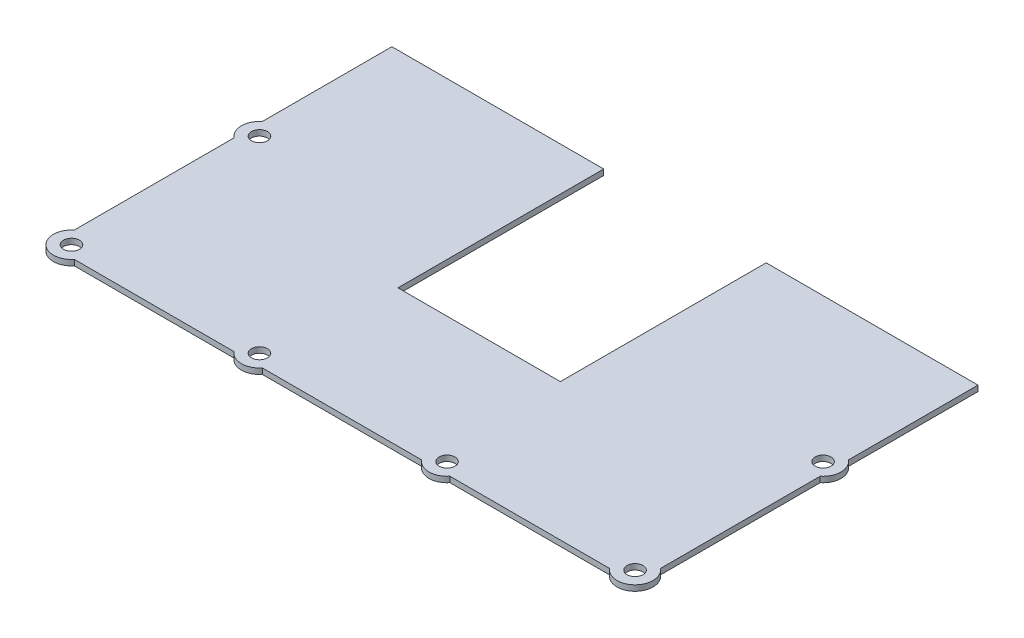
ISO-10303-21;
HEADER;
FILE_DESCRIPTION(('STEP AP214'),'2;1');
FILE_NAME('part.step','',(''),(''),'','','');
FILE_SCHEMA(('AUTOMOTIVE_DESIGN { 1 0 10303 214 1 1 1 1 }'));
ENDSEC;
DATA;
#1=APPLICATION_CONTEXT('core data for automotive mechanical design processes');
#2=APPLICATION_PROTOCOL_DEFINITION('international standard','automotive_design',2000,#1);
#3=PRODUCT_CONTEXT('',#1,'mechanical');
#4=PRODUCT('Part','Part','',(#3));
#5=PRODUCT_RELATED_PRODUCT_CATEGORY('part','',(#4));
#6=PRODUCT_DEFINITION_FORMATION('','',#4);
#7=PRODUCT_DEFINITION_CONTEXT('part definition',#1,'design');
#8=PRODUCT_DEFINITION('design','',#6,#7);
#9=PRODUCT_DEFINITION_SHAPE('','',#8);
#10=(LENGTH_UNIT() NAMED_UNIT(*) SI_UNIT(.MILLI.,.METRE.));
#11=(NAMED_UNIT(*) PLANE_ANGLE_UNIT() SI_UNIT($,.RADIAN.));
#12=(NAMED_UNIT(*) SI_UNIT($,.STERADIAN.) SOLID_ANGLE_UNIT());
#13=UNCERTAINTY_MEASURE_WITH_UNIT(LENGTH_MEASURE(1.E-05),#10,'distance_accuracy_value','');
#14=(GEOMETRIC_REPRESENTATION_CONTEXT(3) GLOBAL_UNCERTAINTY_ASSIGNED_CONTEXT((#13)) GLOBAL_UNIT_ASSIGNED_CONTEXT((#10,
#11,#12)) REPRESENTATION_CONTEXT('',''));
#15=CARTESIAN_POINT('',(0.,0.,0.));
#16=DIRECTION('',(0.,0.,1.));
#17=DIRECTION('',(1.,0.,0.));
#18=AXIS2_PLACEMENT_3D('',#15,#16,#17);
#19=CARTESIAN_POINT('',(161.799492169997,1.5875,40.4400835330655));
#20=DIRECTION('',(0.,1.,0.));
#21=DIRECTION('',(0.,0.,1.));
#22=AXIS2_PLACEMENT_3D('',#19,#20,#21);
#23=PLANE('',#22);
#24=CARTESIAN_POINT('',(161.799492169997,1.5875,93.3567501997322));
#25=DIRECTION('',(0.,1.,0.));
#26=DIRECTION('',(0.,0.,1.));
#27=AXIS2_PLACEMENT_3D('',#24,#25,#26);
#28=CIRCLE('',#27,2.2479);
#29=CARTESIAN_POINT('',(161.799492169997,1.5875,95.6046501997322));
#30=VERTEX_POINT('',#29);
#31=EDGE_CURVE('E437',#30,#30,#28,.T.);
#32=ORIENTED_EDGE('',*,*,#31,.F.);
#33=EDGE_LOOP('',(#32));
#34=FACE_BOUND('',#33,.T.);
#35=CARTESIAN_POINT('',(56.0916666666667,1.5875,93.3567501997322));
#36=DIRECTION('',(0.,1.,0.));
#37=DIRECTION('',(0.,0.,1.));
#38=AXIS2_PLACEMENT_3D('',#35,#36,#37);
#39=CIRCLE('',#38,2.2479);
#40=CARTESIAN_POINT('',(56.0916666666667,1.5875,95.6046501997322));
#41=VERTEX_POINT('',#40);
#42=EDGE_CURVE('E453',#41,#41,#39,.T.);
#43=ORIENTED_EDGE('',*,*,#42,.F.);
#44=EDGE_LOOP('',(#43));
#45=FACE_BOUND('',#44,.T.);
#46=CARTESIAN_POINT('',(3.17499999999999,1.5875,40.4400835330655));
#47=DIRECTION('',(0.,1.,0.));
#48=DIRECTION('',(0.,0.,1.));
#49=AXIS2_PLACEMENT_3D('',#46,#47,#48);
#50=CIRCLE('',#49,2.2479);
#51=CARTESIAN_POINT('',(3.17499999999999,1.5875,42.6879835330655));
#52=VERTEX_POINT('',#51);
#53=EDGE_CURVE('E206',#52,#52,#50,.T.);
#54=ORIENTED_EDGE('',*,*,#53,.F.);
#55=EDGE_LOOP('',(#54));
#56=FACE_BOUND('',#55,.T.);
#57=DIRECTION('',(0.,0.,-1.));
#58=VECTOR('',#57,1.);
#59=CARTESIAN_POINT('',(59.6265,1.5875,0.));
#60=LINE('',#59,#58);
#61=CARTESIAN_POINT('',(59.6265,1.5875,57.9237501997322));
#62=VERTEX_POINT('',#61);
#63=CARTESIAN_POINT('',(59.6265,1.5875,0.));
#64=VERTEX_POINT('',#63);
#65=EDGE_CURVE('E255',#62,#64,#60,.T.);
#66=ORIENTED_EDGE('',*,*,#65,.T.);
#67=DIRECTION('',(-1.,0.,0.));
#68=VECTOR('',#67,1.);
#69=CARTESIAN_POINT('',(59.6265,1.5875,0.));
#70=LINE('',#69,#68);
#71=CARTESIAN_POINT('',(0.,1.5875,0.));
#72=VERTEX_POINT('',#71);
#73=EDGE_CURVE('E130',#64,#72,#70,.T.);
#74=ORIENTED_EDGE('',*,*,#73,.T.);
#75=DIRECTION('',(0.,0.,1.));
#76=VECTOR('',#75,1.);
#77=CARTESIAN_POINT('',(0.,1.5875,0.));
#78=LINE('',#77,#76);
#79=CARTESIAN_POINT('',(0.,1.5875,36.4745098040825));
#80=VERTEX_POINT('',#79);
#81=EDGE_CURVE('E316',#72,#80,#78,.T.);
#82=ORIENTED_EDGE('',*,*,#81,.T.);
#83=CARTESIAN_POINT('',(3.175,1.5875,40.4400835330655));
#84=DIRECTION('',(0.,1.,0.));
#85=DIRECTION('',(0.,0.,1.));
#86=AXIS2_PLACEMENT_3D('',#83,#84,#85);
#87=CIRCLE('',#86,5.08);
#88=CARTESIAN_POINT('',(0.,1.5875,44.4056572620485));
#89=VERTEX_POINT('',#88);
#90=EDGE_CURVE('E336',#80,#89,#87,.T.);
#91=ORIENTED_EDGE('',*,*,#90,.T.);
#92=DIRECTION('',(0.,0.,1.));
#93=VECTOR('',#92,1.);
#94=CARTESIAN_POINT('',(0.,1.5875,44.4056572620485));
#95=LINE('',#94,#93);
#96=CARTESIAN_POINT('',(0.,1.5875,89.3911764707492));
#97=VERTEX_POINT('',#96);
#98=EDGE_CURVE('E332',#89,#97,#95,.T.);
#99=ORIENTED_EDGE('',*,*,#98,.T.);
#100=CARTESIAN_POINT('',(3.175,1.5875,93.3567501997322));
#101=DIRECTION('',(0.,1.,0.));
#102=DIRECTION('',(0.,0.,1.));
#103=AXIS2_PLACEMENT_3D('',#100,#101,#102);
#104=CIRCLE('',#103,5.07999999999999);
#105=CARTESIAN_POINT('',(7.14057372898299,1.5875,96.5317501997322));
#106=VERTEX_POINT('',#105);
#107=EDGE_CURVE('E335',#97,#106,#104,.T.);
#108=ORIENTED_EDGE('',*,*,#107,.T.);
#109=DIRECTION('',(1.,0.,0.));
#110=VECTOR('',#109,1.);
#111=CARTESIAN_POINT('',(7.14057372898299,1.5875,96.5317501997322));
#112=LINE('',#111,#110);
#113=CARTESIAN_POINT('',(52.1260929376837,1.5875,96.5317501997322));
#114=VERTEX_POINT('',#113);
#115=EDGE_CURVE('E340',#106,#114,#112,.T.);
#116=ORIENTED_EDGE('',*,*,#115,.T.);
#117=CARTESIAN_POINT('',(56.0916666666667,1.5875,93.3567501997322));
#118=DIRECTION('',(0.,1.,0.));
#119=DIRECTION('',(0.,0.,1.));
#120=AXIS2_PLACEMENT_3D('',#117,#118,#119);
#121=CIRCLE('',#120,5.08000000000002);
#122=CARTESIAN_POINT('',(60.0572403956497,1.5875,96.5317501997322));
#123=VERTEX_POINT('',#122);
#124=EDGE_CURVE('E347',#114,#123,#121,.T.);
#125=ORIENTED_EDGE('',*,*,#124,.T.);
#126=DIRECTION('',(1.,0.,0.));
#127=VECTOR('',#126,1.);
#128=CARTESIAN_POINT('',(60.0572403956497,1.5875,96.5317501997322));
#129=LINE('',#128,#127);
#130=CARTESIAN_POINT('',(104.917251774347,1.5875,96.5317501997322));
#131=VERTEX_POINT('',#130);
#132=EDGE_CURVE('E350',#123,#131,#129,.T.);
#133=ORIENTED_EDGE('',*,*,#132,.T.);
#134=CARTESIAN_POINT('',(108.88282550333,1.5875,93.3567501997322));
#135=DIRECTION('',(0.,1.,0.));
#136=DIRECTION('',(0.,0.,1.));
#137=AXIS2_PLACEMENT_3D('',#134,#135,#136);
#138=CIRCLE('',#137,5.07999999999999);
#139=CARTESIAN_POINT('',(112.848399232313,1.5875,96.5317501997322));
#140=VERTEX_POINT('',#139);
#141=EDGE_CURVE('E353',#131,#140,#138,.T.);
#142=ORIENTED_EDGE('',*,*,#141,.T.);
#143=DIRECTION('',(1.,0.,0.));
#144=VECTOR('',#143,1.);
#145=CARTESIAN_POINT('',(112.848399232313,1.5875,96.5317501997322));
#146=LINE('',#145,#144);
#147=CARTESIAN_POINT('',(157.833918441014,1.5875,96.5317501997322));
#148=VERTEX_POINT('',#147);
#149=EDGE_CURVE('E356',#140,#148,#146,.T.);
#150=ORIENTED_EDGE('',*,*,#149,.T.);
#151=CARTESIAN_POINT('',(161.799492169997,1.5875,93.3567501997322));
#152=DIRECTION('',(0.,1.,0.));
#153=DIRECTION('',(0.,0.,1.));
#154=AXIS2_PLACEMENT_3D('',#151,#152,#153);
#155=CIRCLE('',#154,5.08000000000002);
#156=CARTESIAN_POINT('',(164.974492169997,1.5875,89.3911764707492));
#157=VERTEX_POINT('',#156);
#158=EDGE_CURVE('E359',#148,#157,#155,.T.);
#159=ORIENTED_EDGE('',*,*,#158,.T.);
#160=DIRECTION('',(0.,0.,-1.));
#161=VECTOR('',#160,1.);
#162=CARTESIAN_POINT('',(164.974492169997,1.5875,89.3911764707492));
#163=LINE('',#162,#161);
#164=CARTESIAN_POINT('',(164.974492169997,1.5875,44.4056572620485));
#165=VERTEX_POINT('',#164);
#166=EDGE_CURVE('E362',#157,#165,#163,.T.);
#167=ORIENTED_EDGE('',*,*,#166,.T.);
#168=CARTESIAN_POINT('',(161.799492169997,1.5875,40.4400835330655));
#169=DIRECTION('',(0.,1.,0.));
#170=DIRECTION('',(0.,0.,1.));
#171=AXIS2_PLACEMENT_3D('',#168,#169,#170);
#172=CIRCLE('',#171,5.08000000000001);
#173=CARTESIAN_POINT('',(164.974492169997,1.5875,36.4745098040825));
#174=VERTEX_POINT('',#173);
#175=EDGE_CURVE('E365',#165,#174,#172,.T.);
#176=ORIENTED_EDGE('',*,*,#175,.T.);
#177=DIRECTION('',(0.,0.,-1.));
#178=VECTOR('',#177,1.);
#179=CARTESIAN_POINT('',(164.974492169997,1.5875,36.4745098040825));
#180=LINE('',#179,#178);
#181=CARTESIAN_POINT('',(164.974492169997,1.5875,0.));
#182=VERTEX_POINT('',#181);
#183=EDGE_CURVE('E179',#174,#182,#180,.T.);
#184=ORIENTED_EDGE('',*,*,#183,.T.);
#185=DIRECTION('',(-1.,0.,0.));
#186=VECTOR('',#185,1.);
#187=CARTESIAN_POINT('',(164.974492169997,1.5875,0.));
#188=LINE('',#187,#186);
#189=CARTESIAN_POINT('',(105.347992169997,1.5875,0.));
#190=VERTEX_POINT('',#189);
#191=EDGE_CURVE('E173',#182,#190,#188,.T.);
#192=ORIENTED_EDGE('',*,*,#191,.T.);
#193=DIRECTION('',(0.,0.,1.));
#194=VECTOR('',#193,1.);
#195=CARTESIAN_POINT('',(105.347992169997,1.5875,0.));
#196=LINE('',#195,#194);
#197=CARTESIAN_POINT('',(105.347992169997,1.5875,57.9237501997322));
#198=VERTEX_POINT('',#197);
#199=EDGE_CURVE('E177',#190,#198,#196,.T.);
#200=ORIENTED_EDGE('',*,*,#199,.T.);
#201=DIRECTION('',(-1.,0.,0.));
#202=VECTOR('',#201,1.);
#203=CARTESIAN_POINT('',(59.6265,1.5875,57.9237501997322));
#204=LINE('',#203,#202);
#205=EDGE_CURVE('E57',#198,#62,#204,.T.);
#206=ORIENTED_EDGE('',*,*,#205,.T.);
#207=EDGE_LOOP('',(#66,#74,#82,#91,#99,#108,#116,#125,#133,#142,#150,#159,#167,#176,#184,#192,
#200,#206));
#208=FACE_BOUND('',#207,.T.);
#209=CARTESIAN_POINT('',(3.17499999999999,1.5875,93.3567501997322));
#210=DIRECTION('',(0.,1.,0.));
#211=DIRECTION('',(0.,0.,1.));
#212=AXIS2_PLACEMENT_3D('',#209,#210,#211);
#213=CIRCLE('',#212,2.2479);
#214=CARTESIAN_POINT('',(3.17499999999999,1.5875,95.6046501997322));
#215=VERTEX_POINT('',#214);
#216=EDGE_CURVE('E461',#215,#215,#213,.T.);
#217=ORIENTED_EDGE('',*,*,#216,.F.);
#218=EDGE_LOOP('',(#217));
#219=FACE_BOUND('',#218,.T.);
#220=CARTESIAN_POINT('',(108.88282550333,1.5875,93.3567501997322));
#221=DIRECTION('',(0.,1.,0.));
#222=DIRECTION('',(0.,0.,1.));
#223=AXIS2_PLACEMENT_3D('',#220,#221,#222);
#224=CIRCLE('',#223,2.2479);
#225=CARTESIAN_POINT('',(108.88282550333,1.5875,95.6046501997322));
#226=VERTEX_POINT('',#225);
#227=EDGE_CURVE('E445',#226,#226,#224,.T.);
#228=ORIENTED_EDGE('',*,*,#227,.F.);
#229=EDGE_LOOP('',(#228));
#230=FACE_BOUND('',#229,.T.);
#231=CARTESIAN_POINT('',(161.799492169997,1.5875,40.4400835330655));
#232=DIRECTION('',(0.,1.,0.));
#233=DIRECTION('',(0.,0.,1.));
#234=AXIS2_PLACEMENT_3D('',#231,#232,#233);
#235=CIRCLE('',#234,2.2479);
#236=CARTESIAN_POINT('',(161.799492169997,1.5875,42.6879835330655));
#237=VERTEX_POINT('',#236);
#238=EDGE_CURVE('E426',#237,#237,#235,.T.);
#239=ORIENTED_EDGE('',*,*,#238,.F.);
#240=EDGE_LOOP('',(#239));
#241=FACE_BOUND('',#240,.T.);
#242=ADVANCED_FACE('F39',(#34,#45,#56,#208,#219,#230,#241),#23,.T.);
#243=CARTESIAN_POINT('',(161.799492169997,0.,40.4400835330655));
#244=DIRECTION('',(0.,1.,0.));
#245=DIRECTION('',(0.,0.,1.));
#246=AXIS2_PLACEMENT_3D('',#243,#244,#245);
#247=PLANE('',#246);
#248=DIRECTION('',(0.,0.,-1.));
#249=VECTOR('',#248,1.);
#250=CARTESIAN_POINT('',(59.6265,0.,0.));
#251=LINE('',#250,#249);
#252=CARTESIAN_POINT('',(59.6265,0.,57.9237501997322));
#253=VERTEX_POINT('',#252);
#254=CARTESIAN_POINT('',(59.6265,0.,0.));
#255=VERTEX_POINT('',#254);
#256=EDGE_CURVE('E201',#253,#255,#251,.T.);
#257=ORIENTED_EDGE('',*,*,#256,.F.);
#258=DIRECTION('',(-1.,0.,0.));
#259=VECTOR('',#258,1.);
#260=CARTESIAN_POINT('',(59.6265,0.,57.9237501997322));
#261=LINE('',#260,#259);
#262=CARTESIAN_POINT('',(105.347992169997,0.,57.9237501997322));
#263=VERTEX_POINT('',#262);
#264=EDGE_CURVE('E122',#263,#253,#261,.T.);
#265=ORIENTED_EDGE('',*,*,#264,.F.);
#266=DIRECTION('',(0.,0.,1.));
#267=VECTOR('',#266,1.);
#268=CARTESIAN_POINT('',(105.347992169997,0.,0.));
#269=LINE('',#268,#267);
#270=CARTESIAN_POINT('',(105.347992169997,0.,0.));
#271=VERTEX_POINT('',#270);
#272=EDGE_CURVE('E116',#271,#263,#269,.T.);
#273=ORIENTED_EDGE('',*,*,#272,.F.);
#274=DIRECTION('',(-1.,0.,0.));
#275=VECTOR('',#274,1.);
#276=CARTESIAN_POINT('',(164.974492169997,0.,0.));
#277=LINE('',#276,#275);
#278=CARTESIAN_POINT('',(164.974492169997,0.,0.));
#279=VERTEX_POINT('',#278);
#280=EDGE_CURVE('E188',#279,#271,#277,.T.);
#281=ORIENTED_EDGE('',*,*,#280,.F.);
#282=DIRECTION('',(0.,0.,-1.));
#283=VECTOR('',#282,1.);
#284=CARTESIAN_POINT('',(164.974492169997,0.,36.4745098040825));
#285=LINE('',#284,#283);
#286=CARTESIAN_POINT('',(164.974492169997,0.,36.4745098040825));
#287=VERTEX_POINT('',#286);
#288=EDGE_CURVE('E246',#287,#279,#285,.T.);
#289=ORIENTED_EDGE('',*,*,#288,.F.);
#290=CARTESIAN_POINT('',(161.799492169997,0.,40.4400835330655));
#291=DIRECTION('',(0.,1.,0.));
#292=DIRECTION('',(0.,0.,1.));
#293=AXIS2_PLACEMENT_3D('',#290,#291,#292);
#294=CIRCLE('',#293,5.08000000000001);
#295=CARTESIAN_POINT('',(164.974492169997,0.,44.4056572620485));
#296=VERTEX_POINT('',#295);
#297=EDGE_CURVE('E243',#296,#287,#294,.T.);
#298=ORIENTED_EDGE('',*,*,#297,.F.);
#299=DIRECTION('',(0.,0.,-1.));
#300=VECTOR('',#299,1.);
#301=CARTESIAN_POINT('',(164.974492169997,0.,89.3911764707492));
#302=LINE('',#301,#300);
#303=CARTESIAN_POINT('',(164.974492169997,0.,89.3911764707492));
#304=VERTEX_POINT('',#303);
#305=EDGE_CURVE('E240',#304,#296,#302,.T.);
#306=ORIENTED_EDGE('',*,*,#305,.F.);
#307=CARTESIAN_POINT('',(161.799492169997,0.,93.3567501997322));
#308=DIRECTION('',(0.,1.,0.));
#309=DIRECTION('',(0.,0.,1.));
#310=AXIS2_PLACEMENT_3D('',#307,#308,#309);
#311=CIRCLE('',#310,5.08000000000002);
#312=CARTESIAN_POINT('',(157.833918441014,0.,96.5317501997322));
#313=VERTEX_POINT('',#312);
#314=EDGE_CURVE('E237',#313,#304,#311,.T.);
#315=ORIENTED_EDGE('',*,*,#314,.F.);
#316=DIRECTION('',(1.,0.,0.));
#317=VECTOR('',#316,1.);
#318=CARTESIAN_POINT('',(112.848399232313,0.,96.5317501997322));
#319=LINE('',#318,#317);
#320=CARTESIAN_POINT('',(112.848399232313,0.,96.5317501997322));
#321=VERTEX_POINT('',#320);
#322=EDGE_CURVE('E234',#321,#313,#319,.T.);
#323=ORIENTED_EDGE('',*,*,#322,.F.);
#324=CARTESIAN_POINT('',(108.88282550333,0.,93.3567501997322));
#325=DIRECTION('',(0.,1.,0.));
#326=DIRECTION('',(0.,0.,1.));
#327=AXIS2_PLACEMENT_3D('',#324,#325,#326);
#328=CIRCLE('',#327,5.07999999999999);
#329=CARTESIAN_POINT('',(104.917251774347,0.,96.5317501997322));
#330=VERTEX_POINT('',#329);
#331=EDGE_CURVE('E231',#330,#321,#328,.T.);
#332=ORIENTED_EDGE('',*,*,#331,.F.);
#333=DIRECTION('',(1.,0.,0.));
#334=VECTOR('',#333,1.);
#335=CARTESIAN_POINT('',(101.6,0.,96.5317501997322));
#336=LINE('',#335,#334);
#337=CARTESIAN_POINT('',(60.0572403956497,0.,96.5317501997322));
#338=VERTEX_POINT('',#337);
#339=EDGE_CURVE('E228',#338,#330,#336,.T.);
#340=ORIENTED_EDGE('',*,*,#339,.F.);
#341=CARTESIAN_POINT('',(56.0916666666667,0.,93.3567501997322));
#342=DIRECTION('',(0.,1.,0.));
#343=DIRECTION('',(0.,0.,1.));
#344=AXIS2_PLACEMENT_3D('',#341,#342,#343);
#345=CIRCLE('',#344,5.08000000000002);
#346=CARTESIAN_POINT('',(52.1260929376837,0.,96.5317501997322));
#347=VERTEX_POINT('',#346);
#348=EDGE_CURVE('E224',#347,#338,#345,.T.);
#349=ORIENTED_EDGE('',*,*,#348,.F.);
#350=DIRECTION('',(1.,0.,0.));
#351=VECTOR('',#350,1.);
#352=CARTESIAN_POINT('',(7.14057372898299,0.,96.5317501997322));
#353=LINE('',#352,#351);
#354=CARTESIAN_POINT('',(7.14057372898299,0.,96.5317501997322));
#355=VERTEX_POINT('',#354);
#356=EDGE_CURVE('E221',#355,#347,#353,.T.);
#357=ORIENTED_EDGE('',*,*,#356,.F.);
#358=CARTESIAN_POINT('',(3.175,0.,93.3567501997322));
#359=DIRECTION('',(0.,1.,0.));
#360=DIRECTION('',(0.,0.,1.));
#361=AXIS2_PLACEMENT_3D('',#358,#359,#360);
#362=CIRCLE('',#361,5.07999999999999);
#363=CARTESIAN_POINT('',(0.,0.,89.3911764707492));
#364=VERTEX_POINT('',#363);
#365=EDGE_CURVE('E218',#364,#355,#362,.T.);
#366=ORIENTED_EDGE('',*,*,#365,.F.);
#367=DIRECTION('',(0.,0.,1.));
#368=VECTOR('',#367,1.);
#369=CARTESIAN_POINT('',(0.,0.,44.4056572620485));
#370=LINE('',#369,#368);
#371=CARTESIAN_POINT('',(0.,0.,44.4056572620485));
#372=VERTEX_POINT('',#371);
#373=EDGE_CURVE('E215',#372,#364,#370,.T.);
#374=ORIENTED_EDGE('',*,*,#373,.F.);
#375=CARTESIAN_POINT('',(3.175,0.,40.4400835330655));
#376=DIRECTION('',(0.,1.,0.));
#377=DIRECTION('',(0.,0.,1.));
#378=AXIS2_PLACEMENT_3D('',#375,#376,#377);
#379=CIRCLE('',#378,5.08);
#380=CARTESIAN_POINT('',(0.,0.,36.4745098040825));
#381=VERTEX_POINT('',#380);
#382=EDGE_CURVE('E212',#381,#372,#379,.T.);
#383=ORIENTED_EDGE('',*,*,#382,.F.);
#384=DIRECTION('',(0.,0.,1.));
#385=VECTOR('',#384,1.);
#386=CARTESIAN_POINT('',(0.,0.,0.));
#387=LINE('',#386,#385);
#388=CARTESIAN_POINT('',(0.,0.,0.));
#389=VERTEX_POINT('',#388);
#390=EDGE_CURVE('E209',#389,#381,#387,.T.);
#391=ORIENTED_EDGE('',*,*,#390,.F.);
#392=DIRECTION('',(-1.,0.,0.));
#393=VECTOR('',#392,1.);
#394=CARTESIAN_POINT('',(59.6265,0.,0.));
#395=LINE('',#394,#393);
#396=EDGE_CURVE('E205',#255,#389,#395,.T.);
#397=ORIENTED_EDGE('',*,*,#396,.F.);
#398=EDGE_LOOP('',(#257,#265,#273,#281,#289,#298,#306,#315,#323,#332,#340,#349,#357,#366,#374,
#383,#391,#397));
#399=FACE_BOUND('',#398,.T.);
#400=CARTESIAN_POINT('',(3.17499999999999,0.,40.4400835330655));
#401=DIRECTION('',(0.,1.,0.));
#402=DIRECTION('',(0.,0.,1.));
#403=AXIS2_PLACEMENT_3D('',#400,#401,#402);
#404=CIRCLE('',#403,2.2479);
#405=CARTESIAN_POINT('',(3.17499999999999,0.,42.6879835330655));
#406=VERTEX_POINT('',#405);
#407=EDGE_CURVE('E465',#406,#406,#404,.T.);
#408=ORIENTED_EDGE('',*,*,#407,.T.);
#409=EDGE_LOOP('',(#408));
#410=FACE_BOUND('',#409,.T.);
#411=CARTESIAN_POINT('',(3.17499999999999,0.,93.3567501997322));
#412=DIRECTION('',(0.,1.,0.));
#413=DIRECTION('',(0.,0.,1.));
#414=AXIS2_PLACEMENT_3D('',#411,#412,#413);
#415=CIRCLE('',#414,2.2479);
#416=CARTESIAN_POINT('',(3.17499999999999,0.,95.6046501997322));
#417=VERTEX_POINT('',#416);
#418=EDGE_CURVE('E457',#417,#417,#415,.T.);
#419=ORIENTED_EDGE('',*,*,#418,.T.);
#420=EDGE_LOOP('',(#419));
#421=FACE_BOUND('',#420,.T.);
#422=CARTESIAN_POINT('',(56.0916666666667,0.,93.3567501997322));
#423=DIRECTION('',(0.,1.,0.));
#424=DIRECTION('',(0.,0.,1.));
#425=AXIS2_PLACEMENT_3D('',#422,#423,#424);
#426=CIRCLE('',#425,2.2479);
#427=CARTESIAN_POINT('',(56.0916666666667,0.,95.6046501997322));
#428=VERTEX_POINT('',#427);
#429=EDGE_CURVE('E449',#428,#428,#426,.T.);
#430=ORIENTED_EDGE('',*,*,#429,.T.);
#431=EDGE_LOOP('',(#430));
#432=FACE_BOUND('',#431,.T.);
#433=CARTESIAN_POINT('',(108.88282550333,0.,93.3567501997322));
#434=DIRECTION('',(0.,1.,0.));
#435=DIRECTION('',(0.,0.,1.));
#436=AXIS2_PLACEMENT_3D('',#433,#434,#435);
#437=CIRCLE('',#436,2.2479);
#438=CARTESIAN_POINT('',(108.88282550333,0.,95.6046501997322));
#439=VERTEX_POINT('',#438);
#440=EDGE_CURVE('E441',#439,#439,#437,.T.);
#441=ORIENTED_EDGE('',*,*,#440,.T.);
#442=EDGE_LOOP('',(#441));
#443=FACE_BOUND('',#442,.T.);
#444=CARTESIAN_POINT('',(161.799492169997,0.,93.3567501997322));
#445=DIRECTION('',(0.,1.,0.));
#446=DIRECTION('',(0.,0.,1.));
#447=AXIS2_PLACEMENT_3D('',#444,#445,#446);
#448=CIRCLE('',#447,2.2479);
#449=CARTESIAN_POINT('',(161.799492169997,0.,95.6046501997322));
#450=VERTEX_POINT('',#449);
#451=EDGE_CURVE('E434',#450,#450,#448,.T.);
#452=ORIENTED_EDGE('',*,*,#451,.T.);
#453=EDGE_LOOP('',(#452));
#454=FACE_BOUND('',#453,.T.);
#455=CARTESIAN_POINT('',(161.799492169997,0.,40.4400835330655));
#456=DIRECTION('',(0.,1.,0.));
#457=DIRECTION('',(0.,0.,1.));
#458=AXIS2_PLACEMENT_3D('',#455,#456,#457);
#459=CIRCLE('',#458,2.2479);
#460=CARTESIAN_POINT('',(161.799492169997,0.,42.6879835330655));
#461=VERTEX_POINT('',#460);
#462=EDGE_CURVE('E429',#461,#461,#459,.T.);
#463=ORIENTED_EDGE('',*,*,#462,.T.);
#464=EDGE_LOOP('',(#463));
#465=FACE_BOUND('',#464,.T.);
#466=ADVANCED_FACE('F320',(#399,#410,#421,#432,#443,#454,#465),#247,.F.);
#467=CARTESIAN_POINT('',(59.6265,1.5875,0.));
#468=DIRECTION('',(-1.,0.,0.));
#469=DIRECTION('',(0.,0.,1.));
#470=AXIS2_PLACEMENT_3D('',#467,#468,#469);
#471=PLANE('',#470);
#472=ORIENTED_EDGE('',*,*,#256,.T.);
#473=DIRECTION('',(0.,-1.,0.));
#474=VECTOR('',#473,1.);
#475=CARTESIAN_POINT('',(59.6265,1.5875,0.));
#476=LINE('',#475,#474);
#477=EDGE_CURVE('E11',#64,#255,#476,.T.);
#478=ORIENTED_EDGE('',*,*,#477,.F.);
#479=ORIENTED_EDGE('',*,*,#65,.F.);
#480=DIRECTION('',(0.,-1.,0.));
#481=VECTOR('',#480,1.);
#482=CARTESIAN_POINT('',(59.6265,1.5875,57.9237501997322));
#483=LINE('',#482,#481);
#484=EDGE_CURVE('E197',#62,#253,#483,.T.);
#485=ORIENTED_EDGE('',*,*,#484,.T.);
#486=EDGE_LOOP('',(#472,#478,#479,#485));
#487=FACE_BOUND('',#486,.T.);
#488=ADVANCED_FACE('F41',(#487),#471,.F.);
#489=CARTESIAN_POINT('',(59.6265,1.5875,0.));
#490=DIRECTION('',(0.,0.,1.));
#491=DIRECTION('',(1.,0.,0.));
#492=AXIS2_PLACEMENT_3D('',#489,#490,#491);
#493=PLANE('',#492);
#494=ORIENTED_EDGE('',*,*,#396,.T.);
#495=DIRECTION('',(0.,-1.,0.));
#496=VECTOR('',#495,1.);
#497=CARTESIAN_POINT('',(0.,1.5875,0.));
#498=LINE('',#497,#496);
#499=EDGE_CURVE('E49',#72,#389,#498,.T.);
#500=ORIENTED_EDGE('',*,*,#499,.F.);
#501=ORIENTED_EDGE('',*,*,#73,.F.);
#502=ORIENTED_EDGE('',*,*,#477,.T.);
#503=EDGE_LOOP('',(#494,#500,#501,#502));
#504=FACE_BOUND('',#503,.T.);
#505=ADVANCED_FACE('F661',(#504),#493,.F.);
#506=CARTESIAN_POINT('',(0.,1.5875,0.));
#507=DIRECTION('',(1.,0.,0.));
#508=DIRECTION('',(0.,0.,-1.));
#509=AXIS2_PLACEMENT_3D('',#506,#507,#508);
#510=PLANE('',#509);
#511=ORIENTED_EDGE('',*,*,#390,.T.);
#512=DIRECTION('',(0.,-1.,0.));
#513=VECTOR('',#512,1.);
#514=CARTESIAN_POINT('',(0.,1.5875,36.4745098040825));
#515=LINE('',#514,#513);
#516=EDGE_CURVE('E306',#80,#381,#515,.T.);
#517=ORIENTED_EDGE('',*,*,#516,.F.);
#518=ORIENTED_EDGE('',*,*,#81,.F.);
#519=ORIENTED_EDGE('',*,*,#499,.T.);
#520=EDGE_LOOP('',(#511,#517,#518,#519));
#521=FACE_BOUND('',#520,.T.);
#522=ADVANCED_FACE('F314',(#521),#510,.F.);
#523=CARTESIAN_POINT('',(3.175,1.5875,40.4400835330655));
#524=DIRECTION('',(0.,-1.,0.));
#525=DIRECTION('',(0.,0.,-1.));
#526=AXIS2_PLACEMENT_3D('',#523,#524,#525);
#527=CYLINDRICAL_SURFACE('',#526,5.08);
#528=ORIENTED_EDGE('',*,*,#382,.T.);
#529=DIRECTION('',(0.,-1.,0.));
#530=VECTOR('',#529,1.);
#531=CARTESIAN_POINT('',(0.,1.5875,44.4056572620485));
#532=LINE('',#531,#530);
#533=EDGE_CURVE('E302',#89,#372,#532,.T.);
#534=ORIENTED_EDGE('',*,*,#533,.F.);
#535=ORIENTED_EDGE('',*,*,#90,.F.);
#536=ORIENTED_EDGE('',*,*,#516,.T.);
#537=EDGE_LOOP('',(#528,#534,#535,#536));
#538=FACE_BOUND('',#537,.T.);
#539=ADVANCED_FACE('F326',(#538),#527,.T.);
#540=CARTESIAN_POINT('',(0.,1.5875,44.4056572620485));
#541=DIRECTION('',(1.,0.,0.));
#542=DIRECTION('',(0.,0.,-1.));
#543=AXIS2_PLACEMENT_3D('',#540,#541,#542);
#544=PLANE('',#543);
#545=ORIENTED_EDGE('',*,*,#373,.T.);
#546=DIRECTION('',(0.,-1.,0.));
#547=VECTOR('',#546,1.);
#548=CARTESIAN_POINT('',(0.,1.5875,89.3911764707492));
#549=LINE('',#548,#547);
#550=EDGE_CURVE('E298',#97,#364,#549,.T.);
#551=ORIENTED_EDGE('',*,*,#550,.F.);
#552=ORIENTED_EDGE('',*,*,#98,.F.);
#553=ORIENTED_EDGE('',*,*,#533,.T.);
#554=EDGE_LOOP('',(#545,#551,#552,#553));
#555=FACE_BOUND('',#554,.T.);
#556=ADVANCED_FACE('F330',(#555),#544,.F.);
#557=CARTESIAN_POINT('',(3.175,1.5875,93.3567501997322));
#558=DIRECTION('',(0.,-1.,0.));
#559=DIRECTION('',(0.,0.,-1.));
#560=AXIS2_PLACEMENT_3D('',#557,#558,#559);
#561=CYLINDRICAL_SURFACE('',#560,5.07999999999999);
#562=ORIENTED_EDGE('',*,*,#365,.T.);
#563=DIRECTION('',(0.,-1.,0.));
#564=VECTOR('',#563,1.);
#565=CARTESIAN_POINT('',(7.14057372898299,1.5875,96.5317501997322));
#566=LINE('',#565,#564);
#567=EDGE_CURVE('E294',#106,#355,#566,.T.);
#568=ORIENTED_EDGE('',*,*,#567,.F.);
#569=ORIENTED_EDGE('',*,*,#107,.F.);
#570=ORIENTED_EDGE('',*,*,#550,.T.);
#571=EDGE_LOOP('',(#562,#568,#569,#570));
#572=FACE_BOUND('',#571,.T.);
#573=ADVANCED_FACE('F626',(#572),#561,.T.);
#574=CARTESIAN_POINT('',(7.14057372898299,1.5875,96.5317501997322));
#575=DIRECTION('',(0.,0.,-1.));
#576=DIRECTION('',(-1.,0.,0.));
#577=AXIS2_PLACEMENT_3D('',#574,#575,#576);
#578=PLANE('',#577);
#579=ORIENTED_EDGE('',*,*,#356,.T.);
#580=DIRECTION('',(0.,-1.,0.));
#581=VECTOR('',#580,1.);
#582=CARTESIAN_POINT('',(52.1260929376837,1.5875,96.5317501997322));
#583=LINE('',#582,#581);
#584=EDGE_CURVE('E290',#114,#347,#583,.T.);
#585=ORIENTED_EDGE('',*,*,#584,.F.);
#586=ORIENTED_EDGE('',*,*,#115,.F.);
#587=ORIENTED_EDGE('',*,*,#567,.T.);
#588=EDGE_LOOP('',(#579,#585,#586,#587));
#589=FACE_BOUND('',#588,.T.);
#590=ADVANCED_FACE('F615',(#589),#578,.F.);
#591=CARTESIAN_POINT('',(56.0916666666667,1.5875,93.3567501997322));
#592=DIRECTION('',(0.,-1.,0.));
#593=DIRECTION('',(0.,0.,-1.));
#594=AXIS2_PLACEMENT_3D('',#591,#592,#593);
#595=CYLINDRICAL_SURFACE('',#594,5.08000000000002);
#596=ORIENTED_EDGE('',*,*,#348,.T.);
#597=DIRECTION('',(0.,-1.,0.));
#598=VECTOR('',#597,1.);
#599=CARTESIAN_POINT('',(60.0572403956497,1.5875,96.5317501997322));
#600=LINE('',#599,#598);
#601=EDGE_CURVE('E286',#123,#338,#600,.T.);
#602=ORIENTED_EDGE('',*,*,#601,.F.);
#603=ORIENTED_EDGE('',*,*,#124,.F.);
#604=ORIENTED_EDGE('',*,*,#584,.T.);
#605=EDGE_LOOP('',(#596,#602,#603,#604));
#606=FACE_BOUND('',#605,.T.);
#607=ADVANCED_FACE('F604',(#606),#595,.T.);
#608=CARTESIAN_POINT('',(101.6,1.5875,96.5317501997322));
#609=DIRECTION('',(0.,0.,-1.));
#610=DIRECTION('',(-1.,0.,0.));
#611=AXIS2_PLACEMENT_3D('',#608,#609,#610);
#612=PLANE('',#611);
#613=ORIENTED_EDGE('',*,*,#339,.T.);
#614=DIRECTION('',(0.,-1.,0.));
#615=VECTOR('',#614,1.);
#616=CARTESIAN_POINT('',(104.917251774347,1.5875,96.5317501997322));
#617=LINE('',#616,#615);
#618=EDGE_CURVE('E282',#131,#330,#617,.T.);
#619=ORIENTED_EDGE('',*,*,#618,.F.);
#620=ORIENTED_EDGE('',*,*,#132,.F.);
#621=ORIENTED_EDGE('',*,*,#601,.T.);
#622=EDGE_LOOP('',(#613,#619,#620,#621));
#623=FACE_BOUND('',#622,.T.);
#624=ADVANCED_FACE('F594',(#623),#612,.F.);
#625=CARTESIAN_POINT('',(108.88282550333,1.5875,93.3567501997322));
#626=DIRECTION('',(0.,-1.,0.));
#627=DIRECTION('',(0.,0.,-1.));
#628=AXIS2_PLACEMENT_3D('',#625,#626,#627);
#629=CYLINDRICAL_SURFACE('',#628,5.07999999999999);
#630=ORIENTED_EDGE('',*,*,#331,.T.);
#631=DIRECTION('',(0.,-1.,0.));
#632=VECTOR('',#631,1.);
#633=CARTESIAN_POINT('',(112.848399232313,1.5875,96.5317501997322));
#634=LINE('',#633,#632);
#635=EDGE_CURVE('E278',#140,#321,#634,.T.);
#636=ORIENTED_EDGE('',*,*,#635,.F.);
#637=ORIENTED_EDGE('',*,*,#141,.F.);
#638=ORIENTED_EDGE('',*,*,#618,.T.);
#639=EDGE_LOOP('',(#630,#636,#637,#638));
#640=FACE_BOUND('',#639,.T.);
#641=ADVANCED_FACE('F584',(#640),#629,.T.);
#642=CARTESIAN_POINT('',(112.848399232313,1.5875,96.5317501997322));
#643=DIRECTION('',(0.,0.,-1.));
#644=DIRECTION('',(-1.,0.,0.));
#645=AXIS2_PLACEMENT_3D('',#642,#643,#644);
#646=PLANE('',#645);
#647=ORIENTED_EDGE('',*,*,#322,.T.);
#648=DIRECTION('',(0.,-1.,0.));
#649=VECTOR('',#648,1.);
#650=CARTESIAN_POINT('',(157.833918441014,1.5875,96.5317501997322));
#651=LINE('',#650,#649);
#652=EDGE_CURVE('E274',#148,#313,#651,.T.);
#653=ORIENTED_EDGE('',*,*,#652,.F.);
#654=ORIENTED_EDGE('',*,*,#149,.F.);
#655=ORIENTED_EDGE('',*,*,#635,.T.);
#656=EDGE_LOOP('',(#647,#653,#654,#655));
#657=FACE_BOUND('',#656,.T.);
#658=ADVANCED_FACE('F574',(#657),#646,.F.);
#659=CARTESIAN_POINT('',(161.799492169997,1.5875,93.3567501997322));
#660=DIRECTION('',(0.,-1.,0.));
#661=DIRECTION('',(0.,0.,-1.));
#662=AXIS2_PLACEMENT_3D('',#659,#660,#661);
#663=CYLINDRICAL_SURFACE('',#662,5.08000000000002);
#664=ORIENTED_EDGE('',*,*,#314,.T.);
#665=DIRECTION('',(0.,-1.,0.));
#666=VECTOR('',#665,1.);
#667=CARTESIAN_POINT('',(164.974492169997,1.5875,89.3911764707492));
#668=LINE('',#667,#666);
#669=EDGE_CURVE('E270',#157,#304,#668,.T.);
#670=ORIENTED_EDGE('',*,*,#669,.F.);
#671=ORIENTED_EDGE('',*,*,#158,.F.);
#672=ORIENTED_EDGE('',*,*,#652,.T.);
#673=EDGE_LOOP('',(#664,#670,#671,#672));
#674=FACE_BOUND('',#673,.T.);
#675=ADVANCED_FACE('F564',(#674),#663,.T.);
#676=CARTESIAN_POINT('',(164.974492169997,1.5875,89.3911764707492));
#677=DIRECTION('',(-1.,0.,0.));
#678=DIRECTION('',(0.,0.,1.));
#679=AXIS2_PLACEMENT_3D('',#676,#677,#678);
#680=PLANE('',#679);
#681=ORIENTED_EDGE('',*,*,#305,.T.);
#682=DIRECTION('',(0.,-1.,0.));
#683=VECTOR('',#682,1.);
#684=CARTESIAN_POINT('',(164.974492169997,1.5875,44.4056572620485));
#685=LINE('',#684,#683);
#686=EDGE_CURVE('E266',#165,#296,#685,.T.);
#687=ORIENTED_EDGE('',*,*,#686,.F.);
#688=ORIENTED_EDGE('',*,*,#166,.F.);
#689=ORIENTED_EDGE('',*,*,#669,.T.);
#690=EDGE_LOOP('',(#681,#687,#688,#689));
#691=FACE_BOUND('',#690,.T.);
#692=ADVANCED_FACE('F555',(#691),#680,.F.);
#693=CARTESIAN_POINT('',(161.799492169997,1.5875,40.4400835330655));
#694=DIRECTION('',(0.,-1.,0.));
#695=DIRECTION('',(0.,0.,-1.));
#696=AXIS2_PLACEMENT_3D('',#693,#694,#695);
#697=CYLINDRICAL_SURFACE('',#696,5.08000000000001);
#698=ORIENTED_EDGE('',*,*,#297,.T.);
#699=DIRECTION('',(0.,-1.,0.));
#700=VECTOR('',#699,1.);
#701=CARTESIAN_POINT('',(164.974492169997,1.5875,36.4745098040825));
#702=LINE('',#701,#700);
#703=EDGE_CURVE('E262',#174,#287,#702,.T.);
#704=ORIENTED_EDGE('',*,*,#703,.F.);
#705=ORIENTED_EDGE('',*,*,#175,.F.);
#706=ORIENTED_EDGE('',*,*,#686,.T.);
#707=EDGE_LOOP('',(#698,#704,#705,#706));
#708=FACE_BOUND('',#707,.T.);
#709=ADVANCED_FACE('F373',(#708),#697,.T.);
#710=CARTESIAN_POINT('',(164.974492169997,1.5875,36.4745098040825));
#711=DIRECTION('',(-1.,0.,0.));
#712=DIRECTION('',(0.,0.,1.));
#713=AXIS2_PLACEMENT_3D('',#710,#711,#712);
#714=PLANE('',#713);
#715=ORIENTED_EDGE('',*,*,#288,.T.);
#716=DIRECTION('',(0.,-1.,0.));
#717=VECTOR('',#716,1.);
#718=CARTESIAN_POINT('',(164.974492169997,1.5875,0.));
#719=LINE('',#718,#717);
#720=EDGE_CURVE('E190',#182,#279,#719,.T.);
#721=ORIENTED_EDGE('',*,*,#720,.F.);
#722=ORIENTED_EDGE('',*,*,#183,.F.);
#723=ORIENTED_EDGE('',*,*,#703,.T.);
#724=EDGE_LOOP('',(#715,#721,#722,#723));
#725=FACE_BOUND('',#724,.T.);
#726=ADVANCED_FACE('F377',(#725),#714,.F.);
#727=CARTESIAN_POINT('',(164.974492169997,1.5875,0.));
#728=DIRECTION('',(0.,0.,1.));
#729=DIRECTION('',(1.,0.,0.));
#730=AXIS2_PLACEMENT_3D('',#727,#728,#729);
#731=PLANE('',#730);
#732=ORIENTED_EDGE('',*,*,#280,.T.);
#733=DIRECTION('',(0.,-1.,0.));
#734=VECTOR('',#733,1.);
#735=CARTESIAN_POINT('',(105.347992169997,1.5875,0.));
#736=LINE('',#735,#734);
#737=EDGE_CURVE('E185',#190,#271,#736,.T.);
#738=ORIENTED_EDGE('',*,*,#737,.F.);
#739=ORIENTED_EDGE('',*,*,#191,.F.);
#740=ORIENTED_EDGE('',*,*,#720,.T.);
#741=EDGE_LOOP('',(#732,#738,#739,#740));
#742=FACE_BOUND('',#741,.T.);
#743=ADVANCED_FACE('F186',(#742),#731,.F.);
#744=CARTESIAN_POINT('',(105.347992169997,1.5875,0.));
#745=DIRECTION('',(1.,0.,0.));
#746=DIRECTION('',(0.,0.,-1.));
#747=AXIS2_PLACEMENT_3D('',#744,#745,#746);
#748=PLANE('',#747);
#749=ORIENTED_EDGE('',*,*,#272,.T.);
#750=DIRECTION('',(0.,-1.,0.));
#751=VECTOR('',#750,1.);
#752=CARTESIAN_POINT('',(105.347992169997,1.5875,57.9237501997322));
#753=LINE('',#752,#751);
#754=EDGE_CURVE('E191',#198,#263,#753,.T.);
#755=ORIENTED_EDGE('',*,*,#754,.F.);
#756=ORIENTED_EDGE('',*,*,#199,.F.);
#757=ORIENTED_EDGE('',*,*,#737,.T.);
#758=EDGE_LOOP('',(#749,#755,#756,#757));
#759=FACE_BOUND('',#758,.T.);
#760=ADVANCED_FACE('F193',(#759),#748,.F.);
#761=CARTESIAN_POINT('',(59.6265,1.5875,57.9237501997322));
#762=DIRECTION('',(0.,0.,1.));
#763=DIRECTION('',(1.,0.,0.));
#764=AXIS2_PLACEMENT_3D('',#761,#762,#763);
#765=PLANE('',#764);
#766=ORIENTED_EDGE('',*,*,#264,.T.);
#767=ORIENTED_EDGE('',*,*,#484,.F.);
#768=ORIENTED_EDGE('',*,*,#205,.F.);
#769=ORIENTED_EDGE('',*,*,#754,.T.);
#770=EDGE_LOOP('',(#766,#767,#768,#769));
#771=FACE_BOUND('',#770,.T.);
#772=ADVANCED_FACE('F381',(#771),#765,.F.);
#773=CARTESIAN_POINT('',(3.17499999999999,1.5875,40.4400835330655));
#774=DIRECTION('',(0.,-1.,0.));
#775=DIRECTION('',(0.,0.,-1.));
#776=AXIS2_PLACEMENT_3D('',#773,#774,#775);
#777=CYLINDRICAL_SURFACE('',#776,2.2479);
#778=ORIENTED_EDGE('',*,*,#53,.T.);
#779=EDGE_LOOP('',(#778));
#780=FACE_BOUND('',#779,.T.);
#781=ORIENTED_EDGE('',*,*,#407,.F.);
#782=EDGE_LOOP('',(#781));
#783=FACE_BOUND('',#782,.T.);
#784=ADVANCED_FACE('F383',(#780,#783),#777,.F.);
#785=CARTESIAN_POINT('',(3.17499999999999,1.5875,93.3567501997322));
#786=DIRECTION('',(0.,-1.,0.));
#787=DIRECTION('',(0.,0.,-1.));
#788=AXIS2_PLACEMENT_3D('',#785,#786,#787);
#789=CYLINDRICAL_SURFACE('',#788,2.2479);
#790=ORIENTED_EDGE('',*,*,#216,.T.);
#791=EDGE_LOOP('',(#790));
#792=FACE_BOUND('',#791,.T.);
#793=ORIENTED_EDGE('',*,*,#418,.F.);
#794=EDGE_LOOP('',(#793));
#795=FACE_BOUND('',#794,.T.);
#796=ADVANCED_FACE('F389',(#792,#795),#789,.F.);
#797=CARTESIAN_POINT('',(56.0916666666667,1.5875,93.3567501997322));
#798=DIRECTION('',(0.,-1.,0.));
#799=DIRECTION('',(0.,0.,-1.));
#800=AXIS2_PLACEMENT_3D('',#797,#798,#799);
#801=CYLINDRICAL_SURFACE('',#800,2.2479);
#802=ORIENTED_EDGE('',*,*,#42,.T.);
#803=EDGE_LOOP('',(#802));
#804=FACE_BOUND('',#803,.T.);
#805=ORIENTED_EDGE('',*,*,#429,.F.);
#806=EDGE_LOOP('',(#805));
#807=FACE_BOUND('',#806,.T.);
#808=ADVANCED_FACE('F405',(#804,#807),#801,.F.);
#809=CARTESIAN_POINT('',(108.88282550333,1.5875,93.3567501997322));
#810=DIRECTION('',(0.,-1.,0.));
#811=DIRECTION('',(0.,0.,-1.));
#812=AXIS2_PLACEMENT_3D('',#809,#810,#811);
#813=CYLINDRICAL_SURFACE('',#812,2.2479);
#814=ORIENTED_EDGE('',*,*,#227,.T.);
#815=EDGE_LOOP('',(#814));
#816=FACE_BOUND('',#815,.T.);
#817=ORIENTED_EDGE('',*,*,#440,.F.);
#818=EDGE_LOOP('',(#817));
#819=FACE_BOUND('',#818,.T.);
#820=ADVANCED_FACE('F409',(#816,#819),#813,.F.);
#821=CARTESIAN_POINT('',(161.799492169997,1.5875,93.3567501997322));
#822=DIRECTION('',(0.,-1.,0.));
#823=DIRECTION('',(0.,0.,-1.));
#824=AXIS2_PLACEMENT_3D('',#821,#822,#823);
#825=CYLINDRICAL_SURFACE('',#824,2.2479);
#826=ORIENTED_EDGE('',*,*,#31,.T.);
#827=EDGE_LOOP('',(#826));
#828=FACE_BOUND('',#827,.T.);
#829=ORIENTED_EDGE('',*,*,#451,.F.);
#830=EDGE_LOOP('',(#829));
#831=FACE_BOUND('',#830,.T.);
#832=ADVANCED_FACE('F413',(#828,#831),#825,.F.);
#833=CARTESIAN_POINT('',(161.799492169997,1.5875,40.4400835330655));
#834=DIRECTION('',(0.,-1.,0.));
#835=DIRECTION('',(0.,0.,-1.));
#836=AXIS2_PLACEMENT_3D('',#833,#834,#835);
#837=CYLINDRICAL_SURFACE('',#836,2.2479);
#838=ORIENTED_EDGE('',*,*,#238,.T.);
#839=EDGE_LOOP('',(#838));
#840=FACE_BOUND('',#839,.T.);
#841=ORIENTED_EDGE('',*,*,#462,.F.);
#842=EDGE_LOOP('',(#841));
#843=FACE_BOUND('',#842,.T.);
#844=ADVANCED_FACE('F417',(#840,#843),#837,.F.);
#845=CLOSED_SHELL('',(#242,#466,#488,#505,#522,#539,#556,#573,#590,#607,#624,#641,#658,#675,
#692,#709,#726,#743,#760,#772,#784,#796,#808,#820,#832,#844));
#846=MANIFOLD_SOLID_BREP('B2',#845);
#847=ADVANCED_BREP_SHAPE_REPRESENTATION('',(#18,#846),#14);
#848=SHAPE_DEFINITION_REPRESENTATION(#9,#847);
ENDSEC;
END-ISO-10303-21;
